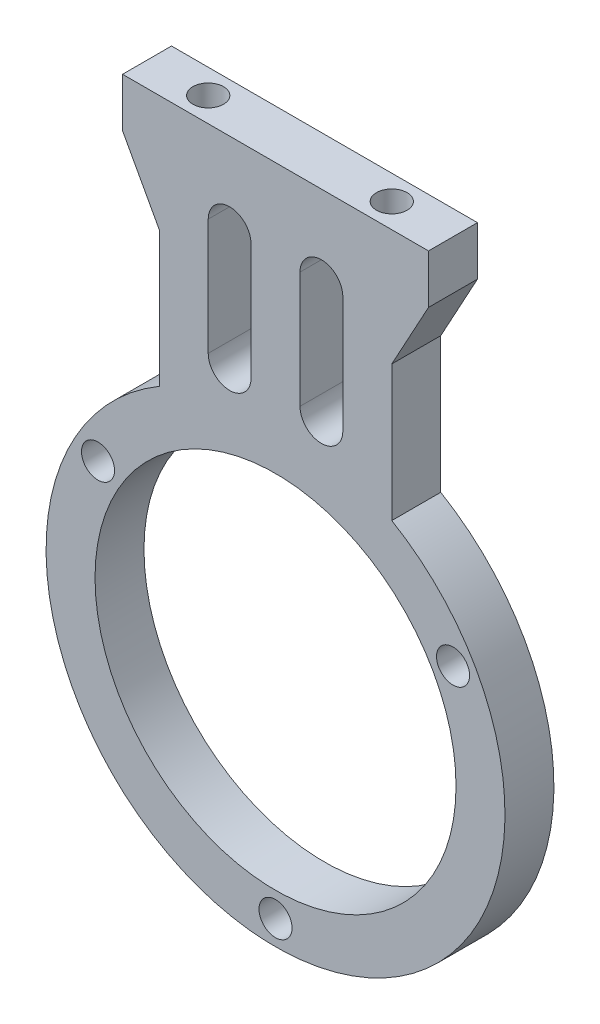
ISO-10303-21;
HEADER;
FILE_DESCRIPTION(('STEP AP214'),'2;1');
FILE_NAME('part.step','',(''),(''),'','','');
FILE_SCHEMA(('AUTOMOTIVE_DESIGN { 1 0 10303 214 1 1 1 1 }'));
ENDSEC;
DATA;
#1=APPLICATION_CONTEXT('core data for automotive mechanical design processes');
#2=APPLICATION_PROTOCOL_DEFINITION('international standard','automotive_design',2000,#1);
#3=PRODUCT_CONTEXT('',#1,'mechanical');
#4=PRODUCT('Part','Part','',(#3));
#5=PRODUCT_RELATED_PRODUCT_CATEGORY('part','',(#4));
#6=PRODUCT_DEFINITION_FORMATION('','',#4);
#7=PRODUCT_DEFINITION_CONTEXT('part definition',#1,'design');
#8=PRODUCT_DEFINITION('design','',#6,#7);
#9=PRODUCT_DEFINITION_SHAPE('','',#8);
#10=(LENGTH_UNIT() NAMED_UNIT(*) SI_UNIT(.MILLI.,.METRE.));
#11=(NAMED_UNIT(*) PLANE_ANGLE_UNIT() SI_UNIT($,.RADIAN.));
#12=(NAMED_UNIT(*) SI_UNIT($,.STERADIAN.) SOLID_ANGLE_UNIT());
#13=UNCERTAINTY_MEASURE_WITH_UNIT(LENGTH_MEASURE(1.E-05),#10,'distance_accuracy_value','');
#14=(GEOMETRIC_REPRESENTATION_CONTEXT(3) GLOBAL_UNCERTAINTY_ASSIGNED_CONTEXT((#13)) GLOBAL_UNIT_ASSIGNED_CONTEXT((#10,
#11,#12)) REPRESENTATION_CONTEXT('',''));
#15=CARTESIAN_POINT('',(0.,0.,0.));
#16=DIRECTION('',(0.,0.,1.));
#17=DIRECTION('',(1.,0.,0.));
#18=AXIS2_PLACEMENT_3D('',#15,#16,#17);
#19=CARTESIAN_POINT('',(7.5,31.75,0.));
#20=DIRECTION('',(0.,1.,0.));
#21=DIRECTION('',(0.,0.,1.));
#22=AXIS2_PLACEMENT_3D('',#19,#20,#21);
#23=PLANE('',#22);
#24=CARTESIAN_POINT('',(7.5,31.75,0.));
#25=DIRECTION('',(0.,-1.,0.));
#26=DIRECTION('',(0.,0.,-1.));
#27=AXIS2_PLACEMENT_3D('',#24,#25,#26);
#28=CIRCLE('',#27,1.25);
#29=CARTESIAN_POINT('',(7.5,31.75,-1.25));
#30=VERTEX_POINT('',#29);
#31=EDGE_CURVE('E20',#30,#30,#28,.F.);
#32=ORIENTED_EDGE('',*,*,#31,.T.);
#33=EDGE_LOOP('',(#32));
#34=FACE_BOUND('',#33,.T.);
#35=ADVANCED_FACE('F17',(#34),#23,.T.);
#36=CARTESIAN_POINT('',(-7.5,31.75,0.));
#37=DIRECTION('',(0.,1.,0.));
#38=DIRECTION('',(0.,0.,1.));
#39=AXIS2_PLACEMENT_3D('',#36,#37,#38);
#40=PLANE('',#39);
#41=CARTESIAN_POINT('',(-7.5,31.75,0.));
#42=DIRECTION('',(0.,-1.,0.));
#43=DIRECTION('',(0.,0.,-1.));
#44=AXIS2_PLACEMENT_3D('',#41,#42,#43);
#45=CIRCLE('',#44,1.25);
#46=CARTESIAN_POINT('',(-7.5,31.75,-1.25));
#47=VERTEX_POINT('',#46);
#48=EDGE_CURVE('E150',#47,#47,#45,.F.);
#49=ORIENTED_EDGE('',*,*,#48,.T.);
#50=EDGE_LOOP('',(#49));
#51=FACE_BOUND('',#50,.T.);
#52=ADVANCED_FACE('F275',(#51),#40,.T.);
#53=CARTESIAN_POINT('',(7.5,36.75,0.));
#54=DIRECTION('',(0.,-1.,0.));
#55=DIRECTION('',(0.,0.,-1.));
#56=AXIS2_PLACEMENT_3D('',#53,#54,#55);
#57=CYLINDRICAL_SURFACE('',#56,1.25);
#58=ORIENTED_EDGE('',*,*,#31,.F.);
#59=EDGE_LOOP('',(#58));
#60=FACE_BOUND('',#59,.T.);
#61=CARTESIAN_POINT('',(7.5,36.75,0.));
#62=DIRECTION('',(0.,-1.,0.));
#63=DIRECTION('',(0.,0.,-1.));
#64=AXIS2_PLACEMENT_3D('',#61,#62,#63);
#65=CIRCLE('',#64,1.25);
#66=CARTESIAN_POINT('',(7.5,36.75,-1.25));
#67=VERTEX_POINT('',#66);
#68=EDGE_CURVE('E262',#67,#67,#65,.T.);
#69=ORIENTED_EDGE('',*,*,#68,.F.);
#70=EDGE_LOOP('',(#69));
#71=FACE_BOUND('',#70,.T.);
#72=ADVANCED_FACE('F271',(#60,#71),#57,.F.);
#73=CARTESIAN_POINT('',(-7.5,36.75,0.));
#74=DIRECTION('',(0.,-1.,0.));
#75=DIRECTION('',(0.,0.,-1.));
#76=AXIS2_PLACEMENT_3D('',#73,#74,#75);
#77=CYLINDRICAL_SURFACE('',#76,1.25);
#78=ORIENTED_EDGE('',*,*,#48,.F.);
#79=EDGE_LOOP('',(#78));
#80=FACE_BOUND('',#79,.T.);
#81=CARTESIAN_POINT('',(-7.5,36.75,0.));
#82=DIRECTION('',(0.,-1.,0.));
#83=DIRECTION('',(0.,0.,-1.));
#84=AXIS2_PLACEMENT_3D('',#81,#82,#83);
#85=CIRCLE('',#84,1.25);
#86=CARTESIAN_POINT('',(-7.5,36.75,-1.25));
#87=VERTEX_POINT('',#86);
#88=EDGE_CURVE('E195',#87,#87,#85,.T.);
#89=ORIENTED_EDGE('',*,*,#88,.F.);
#90=EDGE_LOOP('',(#89));
#91=FACE_BOUND('',#90,.T.);
#92=ADVANCED_FACE('F274',(#80,#91),#77,.F.);
#93=CARTESIAN_POINT('',(0.,9.,2.));
#94=DIRECTION('',(0.,0.,1.));
#95=DIRECTION('',(1.,0.,0.));
#96=AXIS2_PLACEMENT_3D('',#93,#94,#95);
#97=PLANE('',#96);
#98=DIRECTION('',(0.,1.,0.));
#99=VECTOR('',#98,1.);
#100=CARTESIAN_POINT('',(-5.5,20.5,2.));
#101=LINE('',#100,#99);
#102=CARTESIAN_POINT('',(-5.5,20.5,2.));
#103=VERTEX_POINT('',#102);
#104=CARTESIAN_POINT('',(-5.5,30.,2.));
#105=VERTEX_POINT('',#104);
#106=EDGE_CURVE('E168',#103,#105,#101,.T.);
#107=ORIENTED_EDGE('',*,*,#106,.T.);
#108=CARTESIAN_POINT('',(-3.75,30.,2.));
#109=DIRECTION('',(0.,0.,-1.));
#110=DIRECTION('',(-1.,0.,0.));
#111=AXIS2_PLACEMENT_3D('',#108,#109,#110);
#112=CIRCLE('',#111,1.75);
#113=CARTESIAN_POINT('',(-2.,30.,2.));
#114=VERTEX_POINT('',#113);
#115=EDGE_CURVE('E237',#105,#114,#112,.T.);
#116=ORIENTED_EDGE('',*,*,#115,.T.);
#117=DIRECTION('',(0.,1.,0.));
#118=VECTOR('',#117,1.);
#119=CARTESIAN_POINT('',(-2.,30.,2.));
#120=LINE('',#119,#118);
#121=CARTESIAN_POINT('',(-2.,20.5,2.));
#122=VERTEX_POINT('',#121);
#123=EDGE_CURVE('E164',#114,#122,#120,.F.);
#124=ORIENTED_EDGE('',*,*,#123,.T.);
#125=CARTESIAN_POINT('',(-3.75,20.5,2.));
#126=DIRECTION('',(0.,0.,-1.));
#127=DIRECTION('',(-1.,0.,0.));
#128=AXIS2_PLACEMENT_3D('',#125,#126,#127);
#129=CIRCLE('',#128,1.75);
#130=EDGE_CURVE('E239',#122,#103,#129,.T.);
#131=ORIENTED_EDGE('',*,*,#130,.T.);
#132=EDGE_LOOP('',(#107,#116,#124,#131));
#133=FACE_BOUND('',#132,.T.);
#134=DIRECTION('',(0.,-1.,0.));
#135=VECTOR('',#134,1.);
#136=CARTESIAN_POINT('',(2.,20.5,2.));
#137=LINE('',#136,#135);
#138=CARTESIAN_POINT('',(2.,20.5,2.));
#139=VERTEX_POINT('',#138);
#140=CARTESIAN_POINT('',(2.,30.,2.));
#141=VERTEX_POINT('',#140);
#142=EDGE_CURVE('E177',#139,#141,#137,.F.);
#143=ORIENTED_EDGE('',*,*,#142,.T.);
#144=CARTESIAN_POINT('',(3.75,30.,2.));
#145=DIRECTION('',(0.,0.,-1.));
#146=DIRECTION('',(-1.,0.,0.));
#147=AXIS2_PLACEMENT_3D('',#144,#145,#146);
#148=CIRCLE('',#147,1.75);
#149=CARTESIAN_POINT('',(5.5,30.,2.));
#150=VERTEX_POINT('',#149);
#151=EDGE_CURVE('E241',#141,#150,#148,.T.);
#152=ORIENTED_EDGE('',*,*,#151,.T.);
#153=DIRECTION('',(0.,1.,0.));
#154=VECTOR('',#153,1.);
#155=CARTESIAN_POINT('',(5.5,30.,2.));
#156=LINE('',#155,#154);
#157=CARTESIAN_POINT('',(5.5,20.5,2.));
#158=VERTEX_POINT('',#157);
#159=EDGE_CURVE('E172',#150,#158,#156,.F.);
#160=ORIENTED_EDGE('',*,*,#159,.T.);
#161=CARTESIAN_POINT('',(3.75,20.5,2.));
#162=DIRECTION('',(0.,0.,-1.));
#163=DIRECTION('',(-1.,0.,0.));
#164=AXIS2_PLACEMENT_3D('',#161,#162,#163);
#165=CIRCLE('',#164,1.75);
#166=EDGE_CURVE('E243',#158,#139,#165,.T.);
#167=ORIENTED_EDGE('',*,*,#166,.T.);
#168=EDGE_LOOP('',(#143,#152,#160,#167));
#169=FACE_BOUND('',#168,.T.);
#170=CARTESIAN_POINT('',(0.,0.,2.));
#171=DIRECTION('',(0.,0.,-1.));
#172=DIRECTION('',(-1.,0.,0.));
#173=AXIS2_PLACEMENT_3D('',#170,#171,#172);
#174=CIRCLE('',#173,14.75);
#175=CARTESIAN_POINT('',(-14.75,0.,2.));
#176=VERTEX_POINT('',#175);
#177=EDGE_CURVE('E245',#176,#176,#174,.T.);
#178=ORIENTED_EDGE('',*,*,#177,.T.);
#179=EDGE_LOOP('',(#178));
#180=FACE_BOUND('',#179,.T.);
#181=CARTESIAN_POINT('',(-14.5059255133894,8.375,2.));
#182=DIRECTION('',(0.,0.,-1.));
#183=DIRECTION('',(-1.,0.,0.));
#184=AXIS2_PLACEMENT_3D('',#181,#182,#183);
#185=CIRCLE('',#184,1.35);
#186=CARTESIAN_POINT('',(-15.8559255133894,8.375,2.));
#187=VERTEX_POINT('',#186);
#188=EDGE_CURVE('E248',#187,#187,#185,.T.);
#189=ORIENTED_EDGE('',*,*,#188,.T.);
#190=EDGE_LOOP('',(#189));
#191=FACE_BOUND('',#190,.T.);
#192=CARTESIAN_POINT('',(0.,-16.75,2.));
#193=DIRECTION('',(0.,0.,-1.));
#194=DIRECTION('',(-1.,0.,0.));
#195=AXIS2_PLACEMENT_3D('',#192,#193,#194);
#196=CIRCLE('',#195,1.35);
#197=CARTESIAN_POINT('',(-1.35,-16.75,2.));
#198=VERTEX_POINT('',#197);
#199=EDGE_CURVE('E251',#198,#198,#196,.T.);
#200=ORIENTED_EDGE('',*,*,#199,.T.);
#201=EDGE_LOOP('',(#200));
#202=FACE_BOUND('',#201,.T.);
#203=CARTESIAN_POINT('',(14.5059255133894,8.375,2.));
#204=DIRECTION('',(0.,0.,-1.));
#205=DIRECTION('',(-1.,0.,0.));
#206=AXIS2_PLACEMENT_3D('',#203,#204,#205);
#207=CIRCLE('',#206,1.35);
#208=CARTESIAN_POINT('',(13.1559255133894,8.375,2.));
#209=VERTEX_POINT('',#208);
#210=EDGE_CURVE('E254',#209,#209,#207,.T.);
#211=ORIENTED_EDGE('',*,*,#210,.T.);
#212=EDGE_LOOP('',(#211));
#213=FACE_BOUND('',#212,.T.);
#214=DIRECTION('',(0.478852130680573,-0.877895572914385,0.));
#215=VECTOR('',#214,1.);
#216=CARTESIAN_POINT('',(-12.5,32.75,2.));
#217=LINE('',#216,#215);
#218=CARTESIAN_POINT('',(-9.5,27.25,2.));
#219=VERTEX_POINT('',#218);
#220=CARTESIAN_POINT('',(-12.5,32.75,2.));
#221=VERTEX_POINT('',#220);
#222=EDGE_CURVE('E188',#219,#221,#217,.F.);
#223=ORIENTED_EDGE('',*,*,#222,.F.);
#224=DIRECTION('',(0.,1.,0.));
#225=VECTOR('',#224,1.);
#226=CARTESIAN_POINT('',(-9.5,27.25,2.));
#227=LINE('',#226,#225);
#228=CARTESIAN_POINT('',(-9.5,16.1651631603272,2.));
#229=VERTEX_POINT('',#228);
#230=EDGE_CURVE('E106',#229,#219,#227,.T.);
#231=ORIENTED_EDGE('',*,*,#230,.F.);
#232=CARTESIAN_POINT('',(0.,0.,2.));
#233=DIRECTION('',(0.,0.,1.));
#234=DIRECTION('',(1.,0.,0.));
#235=AXIS2_PLACEMENT_3D('',#232,#233,#234);
#236=CIRCLE('',#235,18.75);
#237=CARTESIAN_POINT('',(9.5,16.1651631603272,2.));
#238=VERTEX_POINT('',#237);
#239=EDGE_CURVE('E149',#238,#229,#236,.F.);
#240=ORIENTED_EDGE('',*,*,#239,.F.);
#241=DIRECTION('',(0.,1.,0.));
#242=VECTOR('',#241,1.);
#243=CARTESIAN_POINT('',(9.5,16.1651631603272,2.));
#244=LINE('',#243,#242);
#245=CARTESIAN_POINT('',(9.5,27.25,2.));
#246=VERTEX_POINT('',#245);
#247=EDGE_CURVE('E96',#246,#238,#244,.F.);
#248=ORIENTED_EDGE('',*,*,#247,.F.);
#249=DIRECTION('',(0.478852130680573,0.877895572914385,0.));
#250=VECTOR('',#249,1.);
#251=CARTESIAN_POINT('',(9.5,27.25,2.));
#252=LINE('',#251,#250);
#253=CARTESIAN_POINT('',(12.5,32.75,2.));
#254=VERTEX_POINT('',#253);
#255=EDGE_CURVE('E138',#254,#246,#252,.F.);
#256=ORIENTED_EDGE('',*,*,#255,.F.);
#257=DIRECTION('',(0.,1.,0.));
#258=VECTOR('',#257,1.);
#259=CARTESIAN_POINT('',(12.5,32.75,2.));
#260=LINE('',#259,#258);
#261=CARTESIAN_POINT('',(12.5,36.75,2.));
#262=VERTEX_POINT('',#261);
#263=EDGE_CURVE('E155',#262,#254,#260,.F.);
#264=ORIENTED_EDGE('',*,*,#263,.F.);
#265=DIRECTION('',(1.,0.,0.));
#266=VECTOR('',#265,1.);
#267=CARTESIAN_POINT('',(12.5,36.75,2.));
#268=LINE('',#267,#266);
#269=CARTESIAN_POINT('',(-12.5,36.75,2.));
#270=VERTEX_POINT('',#269);
#271=EDGE_CURVE('E198',#270,#262,#268,.T.);
#272=ORIENTED_EDGE('',*,*,#271,.F.);
#273=DIRECTION('',(0.,1.,0.));
#274=VECTOR('',#273,1.);
#275=CARTESIAN_POINT('',(-12.5,36.75,2.));
#276=LINE('',#275,#274);
#277=EDGE_CURVE('E193',#221,#270,#276,.T.);
#278=ORIENTED_EDGE('',*,*,#277,.F.);
#279=EDGE_LOOP('',(#223,#231,#240,#248,#256,#264,#272,#278));
#280=FACE_BOUND('',#279,.T.);
#281=ADVANCED_FACE('F148',(#133,#169,#180,#191,#202,#213,#280),#97,.T.);
#282=CARTESIAN_POINT('',(9.5,16.1651631603272,0.));
#283=DIRECTION('',(1.,0.,0.));
#284=DIRECTION('',(0.,1.,0.));
#285=AXIS2_PLACEMENT_3D('',#282,#283,#284);
#286=PLANE('',#285);
#287=DIRECTION('',(0.,0.,1.));
#288=VECTOR('',#287,1.);
#289=CARTESIAN_POINT('',(9.5,16.1651631603272,0.));
#290=LINE('',#289,#288);
#291=CARTESIAN_POINT('',(9.5,16.1651631603272,-2.));
#292=VERTEX_POINT('',#291);
#293=EDGE_CURVE('E259',#292,#238,#290,.T.);
#294=ORIENTED_EDGE('',*,*,#293,.F.);
#295=DIRECTION('',(0.,1.,0.));
#296=VECTOR('',#295,1.);
#297=CARTESIAN_POINT('',(9.5,9.,-2.));
#298=LINE('',#297,#296);
#299=CARTESIAN_POINT('',(9.5,27.25,-2.));
#300=VERTEX_POINT('',#299);
#301=EDGE_CURVE('E154',#292,#300,#298,.T.);
#302=ORIENTED_EDGE('',*,*,#301,.T.);
#303=DIRECTION('',(0.,0.,1.));
#304=VECTOR('',#303,1.);
#305=CARTESIAN_POINT('',(9.5,27.25,0.));
#306=LINE('',#305,#304);
#307=EDGE_CURVE('E141',#246,#300,#306,.F.);
#308=ORIENTED_EDGE('',*,*,#307,.F.);
#309=ORIENTED_EDGE('',*,*,#247,.T.);
#310=EDGE_LOOP('',(#294,#302,#308,#309));
#311=FACE_BOUND('',#310,.T.);
#312=ADVANCED_FACE('F153',(#311),#286,.T.);
#313=CARTESIAN_POINT('',(9.5,27.25,0.));
#314=DIRECTION('',(0.877895572914385,-0.478852130680573,0.));
#315=DIRECTION('',(0.478852130680573,0.877895572914385,0.));
#316=AXIS2_PLACEMENT_3D('',#313,#314,#315);
#317=PLANE('',#316);
#318=ORIENTED_EDGE('',*,*,#307,.T.);
#319=DIRECTION('',(0.478852130680573,0.877895572914384,0.));
#320=VECTOR('',#319,1.);
#321=CARTESIAN_POINT('',(9.5,27.25,-2.));
#322=LINE('',#321,#320);
#323=CARTESIAN_POINT('',(12.5,32.75,-2.));
#324=VERTEX_POINT('',#323);
#325=EDGE_CURVE('E305',#300,#324,#322,.T.);
#326=ORIENTED_EDGE('',*,*,#325,.T.);
#327=DIRECTION('',(0.,0.,-1.));
#328=VECTOR('',#327,1.);
#329=CARTESIAN_POINT('',(12.5,32.75,0.));
#330=LINE('',#329,#328);
#331=EDGE_CURVE('E143',#254,#324,#330,.T.);
#332=ORIENTED_EDGE('',*,*,#331,.F.);
#333=ORIENTED_EDGE('',*,*,#255,.T.);
#334=EDGE_LOOP('',(#318,#326,#332,#333));
#335=FACE_BOUND('',#334,.T.);
#336=ADVANCED_FACE('F139',(#335),#317,.T.);
#337=CARTESIAN_POINT('',(12.5,32.75,0.));
#338=DIRECTION('',(1.,0.,0.));
#339=DIRECTION('',(0.,0.,-1.));
#340=AXIS2_PLACEMENT_3D('',#337,#338,#339);
#341=PLANE('',#340);
#342=ORIENTED_EDGE('',*,*,#331,.T.);
#343=DIRECTION('',(0.,1.,0.));
#344=VECTOR('',#343,1.);
#345=CARTESIAN_POINT('',(12.5,9.,-2.));
#346=LINE('',#345,#344);
#347=CARTESIAN_POINT('',(12.5,36.75,-2.));
#348=VERTEX_POINT('',#347);
#349=EDGE_CURVE('E300',#324,#348,#346,.T.);
#350=ORIENTED_EDGE('',*,*,#349,.T.);
#351=DIRECTION('',(0.,0.,1.));
#352=VECTOR('',#351,1.);
#353=CARTESIAN_POINT('',(12.5,36.75,0.));
#354=LINE('',#353,#352);
#355=EDGE_CURVE('E200',#262,#348,#354,.F.);
#356=ORIENTED_EDGE('',*,*,#355,.F.);
#357=ORIENTED_EDGE('',*,*,#263,.T.);
#358=EDGE_LOOP('',(#342,#350,#356,#357));
#359=FACE_BOUND('',#358,.T.);
#360=ADVANCED_FACE('F283',(#359),#341,.T.);
#361=CARTESIAN_POINT('',(12.5,36.75,0.));
#362=DIRECTION('',(0.,1.,0.));
#363=DIRECTION('',(0.,0.,1.));
#364=AXIS2_PLACEMENT_3D('',#361,#362,#363);
#365=PLANE('',#364);
#366=ORIENTED_EDGE('',*,*,#88,.T.);
#367=EDGE_LOOP('',(#366));
#368=FACE_BOUND('',#367,.T.);
#369=ORIENTED_EDGE('',*,*,#68,.T.);
#370=EDGE_LOOP('',(#369));
#371=FACE_BOUND('',#370,.T.);
#372=ORIENTED_EDGE('',*,*,#355,.T.);
#373=DIRECTION('',(1.,0.,0.));
#374=VECTOR('',#373,1.);
#375=CARTESIAN_POINT('',(0.,36.75,-2.));
#376=LINE('',#375,#374);
#377=CARTESIAN_POINT('',(-12.5,36.75,-2.));
#378=VERTEX_POINT('',#377);
#379=EDGE_CURVE('E290',#348,#378,#376,.F.);
#380=ORIENTED_EDGE('',*,*,#379,.T.);
#381=DIRECTION('',(0.,0.,1.));
#382=VECTOR('',#381,1.);
#383=CARTESIAN_POINT('',(-12.5,36.75,0.));
#384=LINE('',#383,#382);
#385=EDGE_CURVE('E190',#270,#378,#384,.F.);
#386=ORIENTED_EDGE('',*,*,#385,.F.);
#387=ORIENTED_EDGE('',*,*,#271,.T.);
#388=EDGE_LOOP('',(#372,#380,#386,#387));
#389=FACE_BOUND('',#388,.T.);
#390=ADVANCED_FACE('F279',(#368,#371,#389),#365,.T.);
#391=CARTESIAN_POINT('',(-12.5,36.75,0.));
#392=DIRECTION('',(-1.,0.,0.));
#393=DIRECTION('',(0.,0.,1.));
#394=AXIS2_PLACEMENT_3D('',#391,#392,#393);
#395=PLANE('',#394);
#396=ORIENTED_EDGE('',*,*,#385,.T.);
#397=DIRECTION('',(0.,1.,0.));
#398=VECTOR('',#397,1.);
#399=CARTESIAN_POINT('',(-12.5,9.,-2.));
#400=LINE('',#399,#398);
#401=CARTESIAN_POINT('',(-12.5,32.75,-2.));
#402=VERTEX_POINT('',#401);
#403=EDGE_CURVE('E303',#378,#402,#400,.F.);
#404=ORIENTED_EDGE('',*,*,#403,.T.);
#405=DIRECTION('',(0.,0.,1.));
#406=VECTOR('',#405,1.);
#407=CARTESIAN_POINT('',(-12.5,32.75,0.));
#408=LINE('',#407,#406);
#409=EDGE_CURVE('E183',#221,#402,#408,.F.);
#410=ORIENTED_EDGE('',*,*,#409,.F.);
#411=ORIENTED_EDGE('',*,*,#277,.T.);
#412=EDGE_LOOP('',(#396,#404,#410,#411));
#413=FACE_BOUND('',#412,.T.);
#414=ADVANCED_FACE('F282',(#413),#395,.T.);
#415=CARTESIAN_POINT('',(-12.5,32.75,0.));
#416=DIRECTION('',(-0.877895572914385,-0.478852130680573,0.));
#417=DIRECTION('',(0.478852130680573,-0.877895572914385,0.));
#418=AXIS2_PLACEMENT_3D('',#415,#416,#417);
#419=PLANE('',#418);
#420=ORIENTED_EDGE('',*,*,#409,.T.);
#421=DIRECTION('',(0.478852130680573,-0.877895572914384,0.));
#422=VECTOR('',#421,1.);
#423=CARTESIAN_POINT('',(-12.5,32.75,-2.));
#424=LINE('',#423,#422);
#425=CARTESIAN_POINT('',(-9.5,27.25,-2.));
#426=VERTEX_POINT('',#425);
#427=EDGE_CURVE('E323',#402,#426,#424,.T.);
#428=ORIENTED_EDGE('',*,*,#427,.T.);
#429=DIRECTION('',(0.,0.,1.));
#430=VECTOR('',#429,1.);
#431=CARTESIAN_POINT('',(-9.5,27.25,0.));
#432=LINE('',#431,#430);
#433=EDGE_CURVE('E182',#219,#426,#432,.F.);
#434=ORIENTED_EDGE('',*,*,#433,.F.);
#435=ORIENTED_EDGE('',*,*,#222,.T.);
#436=EDGE_LOOP('',(#420,#428,#434,#435));
#437=FACE_BOUND('',#436,.T.);
#438=ADVANCED_FACE('F545',(#437),#419,.T.);
#439=CARTESIAN_POINT('',(-9.5,27.25,0.));
#440=DIRECTION('',(-1.,0.,0.));
#441=DIRECTION('',(0.,0.,1.));
#442=AXIS2_PLACEMENT_3D('',#439,#440,#441);
#443=PLANE('',#442);
#444=ORIENTED_EDGE('',*,*,#433,.T.);
#445=DIRECTION('',(0.,1.,0.));
#446=VECTOR('',#445,1.);
#447=CARTESIAN_POINT('',(-9.5,9.,-2.));
#448=LINE('',#447,#446);
#449=CARTESIAN_POINT('',(-9.5,16.1651631603272,-2.));
#450=VERTEX_POINT('',#449);
#451=EDGE_CURVE('E236',#426,#450,#448,.F.);
#452=ORIENTED_EDGE('',*,*,#451,.T.);
#453=DIRECTION('',(0.,0.,1.));
#454=VECTOR('',#453,1.);
#455=CARTESIAN_POINT('',(-9.5,16.1651631603272,0.));
#456=LINE('',#455,#454);
#457=EDGE_CURVE('E257',#229,#450,#456,.F.);
#458=ORIENTED_EDGE('',*,*,#457,.F.);
#459=ORIENTED_EDGE('',*,*,#230,.T.);
#460=EDGE_LOOP('',(#444,#452,#458,#459));
#461=FACE_BOUND('',#460,.T.);
#462=ADVANCED_FACE('F407',(#461),#443,.T.);
#463=CARTESIAN_POINT('',(0.,0.,0.));
#464=DIRECTION('',(0.,0.,1.));
#465=DIRECTION('',(1.,0.,0.));
#466=AXIS2_PLACEMENT_3D('',#463,#464,#465);
#467=CYLINDRICAL_SURFACE('',#466,18.75);
#468=ORIENTED_EDGE('',*,*,#457,.T.);
#469=CARTESIAN_POINT('',(0.,0.,-2.));
#470=DIRECTION('',(0.,0.,1.));
#471=DIRECTION('',(1.,0.,0.));
#472=AXIS2_PLACEMENT_3D('',#469,#470,#471);
#473=CIRCLE('',#472,18.75);
#474=EDGE_CURVE('E233',#450,#292,#473,.T.);
#475=ORIENTED_EDGE('',*,*,#474,.T.);
#476=ORIENTED_EDGE('',*,*,#293,.T.);
#477=ORIENTED_EDGE('',*,*,#239,.T.);
#478=EDGE_LOOP('',(#468,#475,#476,#477));
#479=FACE_BOUND('',#478,.T.);
#480=ADVANCED_FACE('F396',(#479),#467,.T.);
#481=CARTESIAN_POINT('',(14.5059255133894,8.375,2.));
#482=DIRECTION('',(0.,0.,-1.));
#483=DIRECTION('',(-1.,0.,0.));
#484=AXIS2_PLACEMENT_3D('',#481,#482,#483);
#485=CYLINDRICAL_SURFACE('',#484,1.35);
#486=CARTESIAN_POINT('',(14.5059255133894,8.375,-2.));
#487=DIRECTION('',(0.,0.,-1.));
#488=DIRECTION('',(-1.,0.,0.));
#489=AXIS2_PLACEMENT_3D('',#486,#487,#488);
#490=CIRCLE('',#489,1.35);
#491=CARTESIAN_POINT('',(13.1559255133894,8.375,-2.));
#492=VERTEX_POINT('',#491);
#493=EDGE_CURVE('E230',#492,#492,#490,.T.);
#494=ORIENTED_EDGE('',*,*,#493,.T.);
#495=EDGE_LOOP('',(#494));
#496=FACE_BOUND('',#495,.T.);
#497=ORIENTED_EDGE('',*,*,#210,.F.);
#498=EDGE_LOOP('',(#497));
#499=FACE_BOUND('',#498,.T.);
#500=ADVANCED_FACE('F393',(#496,#499),#485,.F.);
#501=CARTESIAN_POINT('',(0.,-16.75,2.));
#502=DIRECTION('',(0.,0.,-1.));
#503=DIRECTION('',(-1.,0.,0.));
#504=AXIS2_PLACEMENT_3D('',#501,#502,#503);
#505=CYLINDRICAL_SURFACE('',#504,1.35);
#506=CARTESIAN_POINT('',(0.,-16.75,-2.));
#507=DIRECTION('',(0.,0.,-1.));
#508=DIRECTION('',(-1.,0.,0.));
#509=AXIS2_PLACEMENT_3D('',#506,#507,#508);
#510=CIRCLE('',#509,1.35);
#511=CARTESIAN_POINT('',(-1.35,-16.75,-2.));
#512=VERTEX_POINT('',#511);
#513=EDGE_CURVE('E227',#512,#512,#510,.T.);
#514=ORIENTED_EDGE('',*,*,#513,.T.);
#515=EDGE_LOOP('',(#514));
#516=FACE_BOUND('',#515,.T.);
#517=ORIENTED_EDGE('',*,*,#199,.F.);
#518=EDGE_LOOP('',(#517));
#519=FACE_BOUND('',#518,.T.);
#520=ADVANCED_FACE('F395',(#516,#519),#505,.F.);
#521=CARTESIAN_POINT('',(-14.5059255133894,8.375,2.));
#522=DIRECTION('',(0.,0.,-1.));
#523=DIRECTION('',(-1.,0.,0.));
#524=AXIS2_PLACEMENT_3D('',#521,#522,#523);
#525=CYLINDRICAL_SURFACE('',#524,1.35);
#526=CARTESIAN_POINT('',(-14.5059255133894,8.375,-2.));
#527=DIRECTION('',(0.,0.,-1.));
#528=DIRECTION('',(-1.,0.,0.));
#529=AXIS2_PLACEMENT_3D('',#526,#527,#528);
#530=CIRCLE('',#529,1.35);
#531=CARTESIAN_POINT('',(-15.8559255133894,8.375,-2.));
#532=VERTEX_POINT('',#531);
#533=EDGE_CURVE('E224',#532,#532,#530,.T.);
#534=ORIENTED_EDGE('',*,*,#533,.T.);
#535=EDGE_LOOP('',(#534));
#536=FACE_BOUND('',#535,.T.);
#537=ORIENTED_EDGE('',*,*,#188,.F.);
#538=EDGE_LOOP('',(#537));
#539=FACE_BOUND('',#538,.T.);
#540=ADVANCED_FACE('F404',(#536,#539),#525,.F.);
#541=CARTESIAN_POINT('',(0.,0.,2.));
#542=DIRECTION('',(0.,0.,-1.));
#543=DIRECTION('',(-1.,0.,0.));
#544=AXIS2_PLACEMENT_3D('',#541,#542,#543);
#545=CYLINDRICAL_SURFACE('',#544,14.75);
#546=CARTESIAN_POINT('',(0.,0.,-2.));
#547=DIRECTION('',(0.,0.,-1.));
#548=DIRECTION('',(-1.,0.,0.));
#549=AXIS2_PLACEMENT_3D('',#546,#547,#548);
#550=CIRCLE('',#549,14.75);
#551=CARTESIAN_POINT('',(-14.75,0.,-2.));
#552=VERTEX_POINT('',#551);
#553=EDGE_CURVE('E221',#552,#552,#550,.T.);
#554=ORIENTED_EDGE('',*,*,#553,.T.);
#555=EDGE_LOOP('',(#554));
#556=FACE_BOUND('',#555,.T.);
#557=ORIENTED_EDGE('',*,*,#177,.F.);
#558=EDGE_LOOP('',(#557));
#559=FACE_BOUND('',#558,.T.);
#560=ADVANCED_FACE('F438',(#556,#559),#545,.F.);
#561=CARTESIAN_POINT('',(3.75,20.5,2.));
#562=DIRECTION('',(0.,0.,-1.));
#563=DIRECTION('',(-1.,0.,0.));
#564=AXIS2_PLACEMENT_3D('',#561,#562,#563);
#565=CYLINDRICAL_SURFACE('',#564,1.75);
#566=DIRECTION('',(0.,0.,1.));
#567=VECTOR('',#566,1.);
#568=CARTESIAN_POINT('',(2.,20.5,2.));
#569=LINE('',#568,#567);
#570=CARTESIAN_POINT('',(2.,20.5,-2.));
#571=VERTEX_POINT('',#570);
#572=EDGE_CURVE('E180',#571,#139,#569,.T.);
#573=ORIENTED_EDGE('',*,*,#572,.T.);
#574=ORIENTED_EDGE('',*,*,#166,.F.);
#575=DIRECTION('',(0.,0.,-1.));
#576=VECTOR('',#575,1.);
#577=CARTESIAN_POINT('',(5.5,20.5,2.));
#578=LINE('',#577,#576);
#579=CARTESIAN_POINT('',(5.5,20.5,-2.));
#580=VERTEX_POINT('',#579);
#581=EDGE_CURVE('E175',#158,#580,#578,.T.);
#582=ORIENTED_EDGE('',*,*,#581,.T.);
#583=CARTESIAN_POINT('',(3.75,20.5,-2.));
#584=DIRECTION('',(0.,0.,-1.));
#585=DIRECTION('',(-1.,0.,0.));
#586=AXIS2_PLACEMENT_3D('',#583,#584,#585);
#587=CIRCLE('',#586,1.75);
#588=EDGE_CURVE('E218',#580,#571,#587,.T.);
#589=ORIENTED_EDGE('',*,*,#588,.T.);
#590=EDGE_LOOP('',(#573,#574,#582,#589));
#591=FACE_BOUND('',#590,.T.);
#592=ADVANCED_FACE('F434',(#591),#565,.F.);
#593=CARTESIAN_POINT('',(2.,20.5,2.));
#594=DIRECTION('',(-1.,0.,0.));
#595=DIRECTION('',(0.,-1.,0.));
#596=AXIS2_PLACEMENT_3D('',#593,#594,#595);
#597=PLANE('',#596);
#598=DIRECTION('',(0.,0.,-1.));
#599=VECTOR('',#598,1.);
#600=CARTESIAN_POINT('',(2.,30.,2.));
#601=LINE('',#600,#599);
#602=CARTESIAN_POINT('',(2.,30.,-2.));
#603=VERTEX_POINT('',#602);
#604=EDGE_CURVE('E179',#603,#141,#601,.F.);
#605=ORIENTED_EDGE('',*,*,#604,.T.);
#606=ORIENTED_EDGE('',*,*,#142,.F.);
#607=ORIENTED_EDGE('',*,*,#572,.F.);
#608=DIRECTION('',(0.,1.,0.));
#609=VECTOR('',#608,1.);
#610=CARTESIAN_POINT('',(2.,9.,-2.));
#611=LINE('',#610,#609);
#612=EDGE_CURVE('E217',#571,#603,#611,.T.);
#613=ORIENTED_EDGE('',*,*,#612,.T.);
#614=EDGE_LOOP('',(#605,#606,#607,#613));
#615=FACE_BOUND('',#614,.T.);
#616=ADVANCED_FACE('F430',(#615),#597,.F.);
#617=CARTESIAN_POINT('',(3.75,30.,2.));
#618=DIRECTION('',(0.,0.,-1.));
#619=DIRECTION('',(-1.,0.,0.));
#620=AXIS2_PLACEMENT_3D('',#617,#618,#619);
#621=CYLINDRICAL_SURFACE('',#620,1.75);
#622=DIRECTION('',(0.,0.,-1.));
#623=VECTOR('',#622,1.);
#624=CARTESIAN_POINT('',(5.5,30.,2.));
#625=LINE('',#624,#623);
#626=CARTESIAN_POINT('',(5.5,30.,-2.));
#627=VERTEX_POINT('',#626);
#628=EDGE_CURVE('E176',#627,#150,#625,.F.);
#629=ORIENTED_EDGE('',*,*,#628,.T.);
#630=ORIENTED_EDGE('',*,*,#151,.F.);
#631=ORIENTED_EDGE('',*,*,#604,.F.);
#632=CARTESIAN_POINT('',(3.75,30.,-2.));
#633=DIRECTION('',(0.,0.,-1.));
#634=DIRECTION('',(-1.,0.,0.));
#635=AXIS2_PLACEMENT_3D('',#632,#633,#634);
#636=CIRCLE('',#635,1.75);
#637=EDGE_CURVE('E214',#603,#627,#636,.T.);
#638=ORIENTED_EDGE('',*,*,#637,.T.);
#639=EDGE_LOOP('',(#629,#630,#631,#638));
#640=FACE_BOUND('',#639,.T.);
#641=ADVANCED_FACE('F426',(#640),#621,.F.);
#642=CARTESIAN_POINT('',(5.5,30.,2.));
#643=DIRECTION('',(1.,0.,0.));
#644=DIRECTION('',(0.,0.,-1.));
#645=AXIS2_PLACEMENT_3D('',#642,#643,#644);
#646=PLANE('',#645);
#647=ORIENTED_EDGE('',*,*,#581,.F.);
#648=ORIENTED_EDGE('',*,*,#159,.F.);
#649=ORIENTED_EDGE('',*,*,#628,.F.);
#650=DIRECTION('',(0.,1.,0.));
#651=VECTOR('',#650,1.);
#652=CARTESIAN_POINT('',(5.5,9.,-2.));
#653=LINE('',#652,#651);
#654=EDGE_CURVE('E213',#627,#580,#653,.F.);
#655=ORIENTED_EDGE('',*,*,#654,.T.);
#656=EDGE_LOOP('',(#647,#648,#649,#655));
#657=FACE_BOUND('',#656,.T.);
#658=ADVANCED_FACE('F423',(#657),#646,.F.);
#659=CARTESIAN_POINT('',(-3.75,20.5,2.));
#660=DIRECTION('',(0.,0.,-1.));
#661=DIRECTION('',(-1.,0.,0.));
#662=AXIS2_PLACEMENT_3D('',#659,#660,#661);
#663=CYLINDRICAL_SURFACE('',#662,1.75);
#664=DIRECTION('',(0.,0.,1.));
#665=VECTOR('',#664,1.);
#666=CARTESIAN_POINT('',(-5.5,20.5,2.));
#667=LINE('',#666,#665);
#668=CARTESIAN_POINT('',(-5.5,20.5,-2.));
#669=VERTEX_POINT('',#668);
#670=EDGE_CURVE('E171',#669,#103,#667,.T.);
#671=ORIENTED_EDGE('',*,*,#670,.T.);
#672=ORIENTED_EDGE('',*,*,#130,.F.);
#673=DIRECTION('',(0.,0.,1.));
#674=VECTOR('',#673,1.);
#675=CARTESIAN_POINT('',(-2.,20.5,2.));
#676=LINE('',#675,#674);
#677=CARTESIAN_POINT('',(-2.,20.5,-2.));
#678=VERTEX_POINT('',#677);
#679=EDGE_CURVE('E167',#122,#678,#676,.F.);
#680=ORIENTED_EDGE('',*,*,#679,.T.);
#681=CARTESIAN_POINT('',(-3.75,20.5,-2.));
#682=DIRECTION('',(0.,0.,-1.));
#683=DIRECTION('',(-1.,0.,0.));
#684=AXIS2_PLACEMENT_3D('',#681,#682,#683);
#685=CIRCLE('',#684,1.75);
#686=EDGE_CURVE('E210',#678,#669,#685,.T.);
#687=ORIENTED_EDGE('',*,*,#686,.T.);
#688=EDGE_LOOP('',(#671,#672,#680,#687));
#689=FACE_BOUND('',#688,.T.);
#690=ADVANCED_FACE('F372',(#689),#663,.F.);
#691=CARTESIAN_POINT('',(-5.5,20.5,2.));
#692=DIRECTION('',(-1.,0.,0.));
#693=DIRECTION('',(0.,0.,1.));
#694=AXIS2_PLACEMENT_3D('',#691,#692,#693);
#695=PLANE('',#694);
#696=DIRECTION('',(0.,0.,-1.));
#697=VECTOR('',#696,1.);
#698=CARTESIAN_POINT('',(-5.5,30.,2.));
#699=LINE('',#698,#697);
#700=CARTESIAN_POINT('',(-5.5,30.,-2.));
#701=VERTEX_POINT('',#700);
#702=EDGE_CURVE('E170',#701,#105,#699,.F.);
#703=ORIENTED_EDGE('',*,*,#702,.T.);
#704=ORIENTED_EDGE('',*,*,#106,.F.);
#705=ORIENTED_EDGE('',*,*,#670,.F.);
#706=DIRECTION('',(0.,1.,0.));
#707=VECTOR('',#706,1.);
#708=CARTESIAN_POINT('',(-5.5,9.,-2.));
#709=LINE('',#708,#707);
#710=EDGE_CURVE('E209',#669,#701,#709,.T.);
#711=ORIENTED_EDGE('',*,*,#710,.T.);
#712=EDGE_LOOP('',(#703,#704,#705,#711));
#713=FACE_BOUND('',#712,.T.);
#714=ADVANCED_FACE('F366',(#713),#695,.F.);
#715=CARTESIAN_POINT('',(-3.75,30.,2.));
#716=DIRECTION('',(0.,0.,-1.));
#717=DIRECTION('',(-1.,0.,0.));
#718=AXIS2_PLACEMENT_3D('',#715,#716,#717);
#719=CYLINDRICAL_SURFACE('',#718,1.75);
#720=DIRECTION('',(0.,0.,1.));
#721=VECTOR('',#720,1.);
#722=CARTESIAN_POINT('',(-2.,30.,2.));
#723=LINE('',#722,#721);
#724=CARTESIAN_POINT('',(-2.,30.,-2.));
#725=VERTEX_POINT('',#724);
#726=EDGE_CURVE('E34',#725,#114,#723,.T.);
#727=ORIENTED_EDGE('',*,*,#726,.T.);
#728=ORIENTED_EDGE('',*,*,#115,.F.);
#729=ORIENTED_EDGE('',*,*,#702,.F.);
#730=CARTESIAN_POINT('',(-3.75,30.,-2.));
#731=DIRECTION('',(0.,0.,-1.));
#732=DIRECTION('',(-1.,0.,0.));
#733=AXIS2_PLACEMENT_3D('',#730,#731,#732);
#734=CIRCLE('',#733,1.75);
#735=EDGE_CURVE('E26',#701,#725,#734,.T.);
#736=ORIENTED_EDGE('',*,*,#735,.T.);
#737=EDGE_LOOP('',(#727,#728,#729,#736));
#738=FACE_BOUND('',#737,.T.);
#739=ADVANCED_FACE('F376',(#738),#719,.F.);
#740=CARTESIAN_POINT('',(-2.,30.,2.));
#741=DIRECTION('',(1.,0.,0.));
#742=DIRECTION('',(0.,1.,0.));
#743=AXIS2_PLACEMENT_3D('',#740,#741,#742);
#744=PLANE('',#743);
#745=ORIENTED_EDGE('',*,*,#679,.F.);
#746=ORIENTED_EDGE('',*,*,#123,.F.);
#747=ORIENTED_EDGE('',*,*,#726,.F.);
#748=DIRECTION('',(0.,1.,0.));
#749=VECTOR('',#748,1.);
#750=CARTESIAN_POINT('',(-2.,9.,-2.));
#751=LINE('',#750,#749);
#752=EDGE_CURVE('E11',#725,#678,#751,.F.);
#753=ORIENTED_EDGE('',*,*,#752,.T.);
#754=EDGE_LOOP('',(#745,#746,#747,#753));
#755=FACE_BOUND('',#754,.T.);
#756=ADVANCED_FACE('F374',(#755),#744,.F.);
#757=CARTESIAN_POINT('',(0.,9.,-2.));
#758=DIRECTION('',(0.,0.,1.));
#759=DIRECTION('',(1.,0.,0.));
#760=AXIS2_PLACEMENT_3D('',#757,#758,#759);
#761=PLANE('',#760);
#762=ORIENTED_EDGE('',*,*,#735,.F.);
#763=ORIENTED_EDGE('',*,*,#710,.F.);
#764=ORIENTED_EDGE('',*,*,#686,.F.);
#765=ORIENTED_EDGE('',*,*,#752,.F.);
#766=EDGE_LOOP('',(#762,#763,#764,#765));
#767=FACE_BOUND('',#766,.T.);
#768=ORIENTED_EDGE('',*,*,#637,.F.);
#769=ORIENTED_EDGE('',*,*,#612,.F.);
#770=ORIENTED_EDGE('',*,*,#588,.F.);
#771=ORIENTED_EDGE('',*,*,#654,.F.);
#772=EDGE_LOOP('',(#768,#769,#770,#771));
#773=FACE_BOUND('',#772,.T.);
#774=ORIENTED_EDGE('',*,*,#553,.F.);
#775=EDGE_LOOP('',(#774));
#776=FACE_BOUND('',#775,.T.);
#777=ORIENTED_EDGE('',*,*,#533,.F.);
#778=EDGE_LOOP('',(#777));
#779=FACE_BOUND('',#778,.T.);
#780=ORIENTED_EDGE('',*,*,#513,.F.);
#781=EDGE_LOOP('',(#780));
#782=FACE_BOUND('',#781,.T.);
#783=ORIENTED_EDGE('',*,*,#493,.F.);
#784=EDGE_LOOP('',(#783));
#785=FACE_BOUND('',#784,.T.);
#786=ORIENTED_EDGE('',*,*,#451,.F.);
#787=ORIENTED_EDGE('',*,*,#427,.F.);
#788=ORIENTED_EDGE('',*,*,#403,.F.);
#789=ORIENTED_EDGE('',*,*,#379,.F.);
#790=ORIENTED_EDGE('',*,*,#349,.F.);
#791=ORIENTED_EDGE('',*,*,#325,.F.);
#792=ORIENTED_EDGE('',*,*,#301,.F.);
#793=ORIENTED_EDGE('',*,*,#474,.F.);
#794=EDGE_LOOP('',(#786,#787,#788,#789,#790,#791,#792,#793));
#795=FACE_BOUND('',#794,.T.);
#796=ADVANCED_FACE('F299',(#767,#773,#776,#779,#782,#785,#795),#761,.F.);
#797=CLOSED_SHELL('',(#35,#52,#72,#92,#281,#312,#336,#360,#390,#414,#438,#462,#480,#500,#520,
#540,#560,#592,#616,#641,#658,#690,#714,#739,#756,#796));
#798=MANIFOLD_SOLID_BREP('B1',#797);
#799=ADVANCED_BREP_SHAPE_REPRESENTATION('',(#18,#798),#14);
#800=SHAPE_DEFINITION_REPRESENTATION(#9,#799);
ENDSEC;
END-ISO-10303-21;
